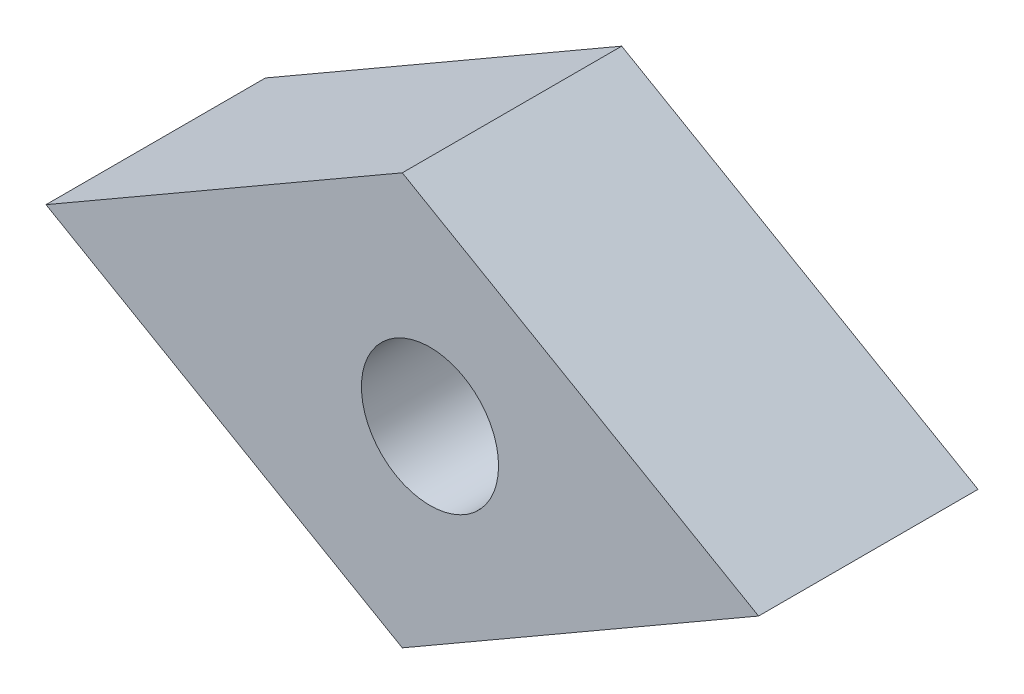
ISO-10303-21;
HEADER;
FILE_DESCRIPTION(('STEP AP214'),'2;1');
FILE_NAME('part.step','',(''),(''),'','','');
FILE_SCHEMA(('AUTOMOTIVE_DESIGN { 1 0 10303 214 1 1 1 1 }'));
ENDSEC;
DATA;
#1=APPLICATION_CONTEXT('core data for automotive mechanical design processes');
#2=APPLICATION_PROTOCOL_DEFINITION('international standard','automotive_design',2000,#1);
#3=PRODUCT_CONTEXT('',#1,'mechanical');
#4=PRODUCT('Part','Part','',(#3));
#5=PRODUCT_RELATED_PRODUCT_CATEGORY('part','',(#4));
#6=PRODUCT_DEFINITION_FORMATION('','',#4);
#7=PRODUCT_DEFINITION_CONTEXT('part definition',#1,'design');
#8=PRODUCT_DEFINITION('design','',#6,#7);
#9=PRODUCT_DEFINITION_SHAPE('','',#8);
#10=(LENGTH_UNIT() NAMED_UNIT(*) SI_UNIT(.MILLI.,.METRE.));
#11=(NAMED_UNIT(*) PLANE_ANGLE_UNIT() SI_UNIT($,.RADIAN.));
#12=(NAMED_UNIT(*) SI_UNIT($,.STERADIAN.) SOLID_ANGLE_UNIT());
#13=UNCERTAINTY_MEASURE_WITH_UNIT(LENGTH_MEASURE(1.E-05),#10,'distance_accuracy_value','');
#14=(GEOMETRIC_REPRESENTATION_CONTEXT(3) GLOBAL_UNCERTAINTY_ASSIGNED_CONTEXT((#13)) GLOBAL_UNIT_ASSIGNED_CONTEXT((#10,
#11,#12)) REPRESENTATION_CONTEXT('',''));
#15=CARTESIAN_POINT('',(0.,0.,0.));
#16=DIRECTION('',(0.,0.,1.));
#17=DIRECTION('',(1.,0.,0.));
#18=AXIS2_PLACEMENT_3D('',#15,#16,#17);
#19=CARTESIAN_POINT('',(12.9903810567668,0.,8.));
#20=DIRECTION('',(-0.499999999999989,-0.866025403784445,0.));
#21=DIRECTION('',(0.866025403784445,-0.499999999999989,0.));
#22=AXIS2_PLACEMENT_3D('',#19,#20,#21);
#23=PLANE('',#22);
#24=DIRECTION('',(-0.866025403784445,0.499999999999989,0.));
#25=VECTOR('',#24,1.);
#26=CARTESIAN_POINT('',(12.9903810567668,0.,0.));
#27=LINE('',#26,#25);
#28=CARTESIAN_POINT('',(12.9903810567668,0.,0.));
#29=VERTEX_POINT('',#28);
#30=CARTESIAN_POINT('',(0.,7.4999999999999,0.));
#31=VERTEX_POINT('',#30);
#32=EDGE_CURVE('E101',#29,#31,#27,.T.);
#33=ORIENTED_EDGE('',*,*,#32,.T.);
#34=DIRECTION('',(0.,0.,-1.));
#35=VECTOR('',#34,1.);
#36=CARTESIAN_POINT('',(0.,7.4999999999999,8.));
#37=LINE('',#36,#35);
#38=CARTESIAN_POINT('',(0.,7.4999999999999,8.));
#39=VERTEX_POINT('',#38);
#40=EDGE_CURVE('E11',#39,#31,#37,.T.);
#41=ORIENTED_EDGE('',*,*,#40,.F.);
#42=DIRECTION('',(-0.866025403784445,0.499999999999989,0.));
#43=VECTOR('',#42,1.);
#44=CARTESIAN_POINT('',(12.9903810567668,0.,8.));
#45=LINE('',#44,#43);
#46=CARTESIAN_POINT('',(12.9903810567668,0.,8.));
#47=VERTEX_POINT('',#46);
#48=EDGE_CURVE('E88',#47,#39,#45,.T.);
#49=ORIENTED_EDGE('',*,*,#48,.F.);
#50=DIRECTION('',(0.,0.,-1.));
#51=VECTOR('',#50,1.);
#52=CARTESIAN_POINT('',(12.9903810567668,0.,8.));
#53=LINE('',#52,#51);
#54=EDGE_CURVE('E97',#47,#29,#53,.T.);
#55=ORIENTED_EDGE('',*,*,#54,.T.);
#56=EDGE_LOOP('',(#33,#41,#49,#55));
#57=FACE_BOUND('',#56,.T.);
#58=ADVANCED_FACE('F36',(#57),#23,.F.);
#59=CARTESIAN_POINT('',(0.,7.4999999999999,8.));
#60=DIRECTION('',(0.499999999999995,-0.866025403784441,0.));
#61=DIRECTION('',(0.866025403784442,0.499999999999995,0.));
#62=AXIS2_PLACEMENT_3D('',#59,#60,#61);
#63=PLANE('',#62);
#64=DIRECTION('',(-0.866025403784441,-0.499999999999995,0.));
#65=VECTOR('',#64,1.);
#66=CARTESIAN_POINT('',(0.,7.4999999999999,0.));
#67=LINE('',#66,#65);
#68=CARTESIAN_POINT('',(-12.9903810567666,0.,0.));
#69=VERTEX_POINT('',#68);
#70=EDGE_CURVE('E92',#31,#69,#67,.T.);
#71=ORIENTED_EDGE('',*,*,#70,.T.);
#72=DIRECTION('',(0.,0.,-1.));
#73=VECTOR('',#72,1.);
#74=CARTESIAN_POINT('',(-12.9903810567666,0.,8.));
#75=LINE('',#74,#73);
#76=CARTESIAN_POINT('',(-12.9903810567666,0.,8.));
#77=VERTEX_POINT('',#76);
#78=EDGE_CURVE('E45',#77,#69,#75,.T.);
#79=ORIENTED_EDGE('',*,*,#78,.F.);
#80=DIRECTION('',(-0.866025403784441,-0.499999999999995,0.));
#81=VECTOR('',#80,1.);
#82=CARTESIAN_POINT('',(0.,7.4999999999999,8.));
#83=LINE('',#82,#81);
#84=EDGE_CURVE('E83',#39,#77,#83,.T.);
#85=ORIENTED_EDGE('',*,*,#84,.F.);
#86=ORIENTED_EDGE('',*,*,#40,.T.);
#87=EDGE_LOOP('',(#71,#79,#85,#86));
#88=FACE_BOUND('',#87,.T.);
#89=ADVANCED_FACE('F91',(#88),#63,.F.);
#90=CARTESIAN_POINT('',(-12.9903810567666,0.,8.));
#91=DIRECTION('',(0.500000000000001,0.866025403784438,0.));
#92=DIRECTION('',(-0.866025403784438,0.500000000000001,0.));
#93=AXIS2_PLACEMENT_3D('',#90,#91,#92);
#94=PLANE('',#93);
#95=DIRECTION('',(0.866025403784438,-0.500000000000001,0.));
#96=VECTOR('',#95,1.);
#97=CARTESIAN_POINT('',(-12.9903810567666,0.,0.));
#98=LINE('',#97,#96);
#99=CARTESIAN_POINT('',(0.,-7.50000000000001,0.));
#100=VERTEX_POINT('',#99);
#101=EDGE_CURVE('E70',#69,#100,#98,.T.);
#102=ORIENTED_EDGE('',*,*,#101,.T.);
#103=DIRECTION('',(0.,0.,-1.));
#104=VECTOR('',#103,1.);
#105=CARTESIAN_POINT('',(0.,-7.50000000000001,8.));
#106=LINE('',#105,#104);
#107=CARTESIAN_POINT('',(0.,-7.50000000000001,8.));
#108=VERTEX_POINT('',#107);
#109=EDGE_CURVE('E93',#108,#100,#106,.T.);
#110=ORIENTED_EDGE('',*,*,#109,.F.);
#111=DIRECTION('',(0.866025403784438,-0.500000000000001,0.));
#112=VECTOR('',#111,1.);
#113=CARTESIAN_POINT('',(-12.9903810567666,0.,8.));
#114=LINE('',#113,#112);
#115=EDGE_CURVE('E86',#77,#108,#114,.T.);
#116=ORIENTED_EDGE('',*,*,#115,.F.);
#117=ORIENTED_EDGE('',*,*,#78,.T.);
#118=EDGE_LOOP('',(#102,#110,#116,#117));
#119=FACE_BOUND('',#118,.T.);
#120=ADVANCED_FACE('F95',(#119),#94,.F.);
#121=CARTESIAN_POINT('',(0.,-7.50000000000001,8.));
#122=DIRECTION('',(-0.499999999999995,0.866025403784441,0.));
#123=DIRECTION('',(-0.866025403784442,-0.499999999999995,0.));
#124=AXIS2_PLACEMENT_3D('',#121,#122,#123);
#125=PLANE('',#124);
#126=DIRECTION('',(0.866025403784442,0.499999999999995,0.));
#127=VECTOR('',#126,1.);
#128=CARTESIAN_POINT('',(0.,-7.50000000000001,0.));
#129=LINE('',#128,#127);
#130=EDGE_CURVE('E76',#100,#29,#129,.T.);
#131=ORIENTED_EDGE('',*,*,#130,.T.);
#132=ORIENTED_EDGE('',*,*,#54,.F.);
#133=DIRECTION('',(0.866025403784442,0.499999999999995,0.));
#134=VECTOR('',#133,1.);
#135=CARTESIAN_POINT('',(0.,-7.50000000000001,8.));
#136=LINE('',#135,#134);
#137=EDGE_CURVE('E53',#108,#47,#136,.T.);
#138=ORIENTED_EDGE('',*,*,#137,.F.);
#139=ORIENTED_EDGE('',*,*,#109,.T.);
#140=EDGE_LOOP('',(#131,#132,#138,#139));
#141=FACE_BOUND('',#140,.T.);
#142=ADVANCED_FACE('F108',(#141),#125,.F.);
#143=CARTESIAN_POINT('',(0.,0.,8.));
#144=DIRECTION('',(0.,0.,1.));
#145=DIRECTION('',(1.,0.,0.));
#146=AXIS2_PLACEMENT_3D('',#143,#144,#145);
#147=PLANE('',#146);
#148=CARTESIAN_POINT('',(1.00961894323343,0.,8.));
#149=DIRECTION('',(0.,0.,1.));
#150=DIRECTION('',(1.,0.,0.));
#151=AXIS2_PLACEMENT_3D('',#148,#149,#150);
#152=CIRCLE('',#151,2.50000000000001);
#153=CARTESIAN_POINT('',(3.50961894323344,0.,8.));
#154=VERTEX_POINT('',#153);
#155=EDGE_CURVE('E120',#154,#154,#152,.T.);
#156=ORIENTED_EDGE('',*,*,#155,.F.);
#157=EDGE_LOOP('',(#156));
#158=FACE_BOUND('',#157,.T.);
#159=ORIENTED_EDGE('',*,*,#48,.T.);
#160=ORIENTED_EDGE('',*,*,#84,.T.);
#161=ORIENTED_EDGE('',*,*,#115,.T.);
#162=ORIENTED_EDGE('',*,*,#137,.T.);
#163=EDGE_LOOP('',(#159,#160,#161,#162));
#164=FACE_BOUND('',#163,.T.);
#165=ADVANCED_FACE('F84',(#158,#164),#147,.T.);
#166=CARTESIAN_POINT('',(0.,0.,0.));
#167=DIRECTION('',(0.,0.,1.));
#168=DIRECTION('',(1.,0.,0.));
#169=AXIS2_PLACEMENT_3D('',#166,#167,#168);
#170=PLANE('',#169);
#171=CARTESIAN_POINT('',(1.00961894323343,0.,0.));
#172=DIRECTION('',(0.,0.,1.));
#173=DIRECTION('',(1.,0.,0.));
#174=AXIS2_PLACEMENT_3D('',#171,#172,#173);
#175=CIRCLE('',#174,1.50000000000001);
#176=CARTESIAN_POINT('',(2.50961894323344,0.,0.));
#177=VERTEX_POINT('',#176);
#178=EDGE_CURVE('E39',#177,#177,#175,.T.);
#179=ORIENTED_EDGE('',*,*,#178,.T.);
#180=EDGE_LOOP('',(#179));
#181=FACE_BOUND('',#180,.T.);
#182=ORIENTED_EDGE('',*,*,#32,.F.);
#183=ORIENTED_EDGE('',*,*,#130,.F.);
#184=ORIENTED_EDGE('',*,*,#101,.F.);
#185=ORIENTED_EDGE('',*,*,#70,.F.);
#186=EDGE_LOOP('',(#182,#183,#184,#185));
#187=FACE_BOUND('',#186,.T.);
#188=ADVANCED_FACE('F111',(#181,#187),#170,.F.);
#189=CARTESIAN_POINT('',(1.00961894323343,0.,8.));
#190=DIRECTION('',(0.,0.,1.));
#191=DIRECTION('',(1.,0.,0.));
#192=AXIS2_PLACEMENT_3D('',#189,#190,#191);
#193=CYLINDRICAL_SURFACE('',#192,1.50000000000001);
#194=CARTESIAN_POINT('',(1.00961894323343,0.,4.));
#195=DIRECTION('',(0.,0.,1.));
#196=DIRECTION('',(1.,0.,0.));
#197=AXIS2_PLACEMENT_3D('',#194,#195,#196);
#198=CIRCLE('',#197,1.50000000000001);
#199=CARTESIAN_POINT('',(2.50961894323344,0.,4.));
#200=VERTEX_POINT('',#199);
#201=EDGE_CURVE('E114',#200,#200,#198,.T.);
#202=ORIENTED_EDGE('',*,*,#201,.T.);
#203=EDGE_LOOP('',(#202));
#204=FACE_BOUND('',#203,.T.);
#205=ORIENTED_EDGE('',*,*,#178,.F.);
#206=EDGE_LOOP('',(#205));
#207=FACE_BOUND('',#206,.T.);
#208=ADVANCED_FACE('F132',(#204,#207),#193,.F.);
#209=CARTESIAN_POINT('',(2.50961894323344,0.,4.));
#210=DIRECTION('',(0.,0.,-1.));
#211=DIRECTION('',(-1.,0.,0.));
#212=AXIS2_PLACEMENT_3D('',#209,#210,#211);
#213=PLANE('',#212);
#214=ORIENTED_EDGE('',*,*,#201,.F.);
#215=EDGE_LOOP('',(#214));
#216=FACE_BOUND('',#215,.T.);
#217=CARTESIAN_POINT('',(1.00961894323343,0.,4.));
#218=DIRECTION('',(0.,0.,1.));
#219=DIRECTION('',(1.,0.,0.));
#220=AXIS2_PLACEMENT_3D('',#217,#218,#219);
#221=CIRCLE('',#220,2.50000000000001);
#222=CARTESIAN_POINT('',(3.50961894323344,0.,4.));
#223=VERTEX_POINT('',#222);
#224=EDGE_CURVE('E117',#223,#223,#221,.T.);
#225=ORIENTED_EDGE('',*,*,#224,.T.);
#226=EDGE_LOOP('',(#225));
#227=FACE_BOUND('',#226,.T.);
#228=ADVANCED_FACE('F171',(#216,#227),#213,.F.);
#229=CARTESIAN_POINT('',(1.00961894323343,0.,8.));
#230=DIRECTION('',(0.,0.,1.));
#231=DIRECTION('',(1.,0.,0.));
#232=AXIS2_PLACEMENT_3D('',#229,#230,#231);
#233=CYLINDRICAL_SURFACE('',#232,2.50000000000001);
#234=ORIENTED_EDGE('',*,*,#224,.F.);
#235=EDGE_LOOP('',(#234));
#236=FACE_BOUND('',#235,.T.);
#237=ORIENTED_EDGE('',*,*,#155,.T.);
#238=EDGE_LOOP('',(#237));
#239=FACE_BOUND('',#238,.T.);
#240=ADVANCED_FACE('F124',(#236,#239),#233,.F.);
#241=CLOSED_SHELL('',(#58,#89,#120,#142,#165,#188,#208,#228,#240));
#242=MANIFOLD_SOLID_BREP('B2',#241);
#243=ADVANCED_BREP_SHAPE_REPRESENTATION('',(#18,#242),#14);
#244=SHAPE_DEFINITION_REPRESENTATION(#9,#243);
ENDSEC;
END-ISO-10303-21;
